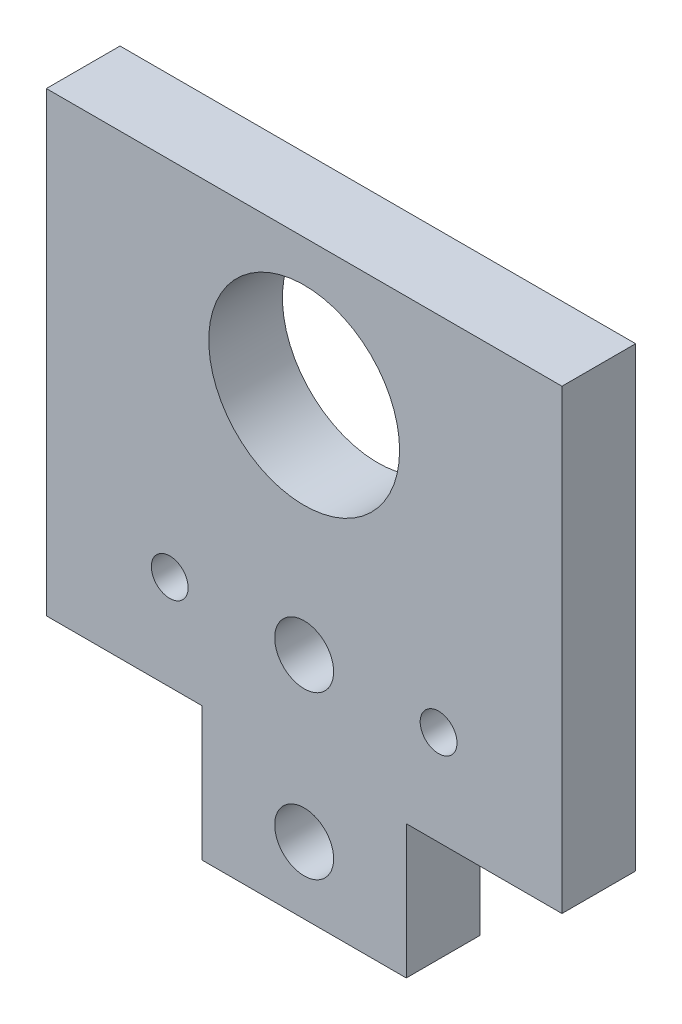
ISO-10303-21;
HEADER;
FILE_DESCRIPTION(('STEP AP214'),'2;1');
FILE_NAME('part.step','',(''),(''),'','','');
FILE_SCHEMA(('AUTOMOTIVE_DESIGN { 1 0 10303 214 1 1 1 1 }'));
ENDSEC;
DATA;
#1=APPLICATION_CONTEXT('core data for automotive mechanical design processes');
#2=APPLICATION_PROTOCOL_DEFINITION('international standard','automotive_design',2000,#1);
#3=PRODUCT_CONTEXT('',#1,'mechanical');
#4=PRODUCT('Part','Part','',(#3));
#5=PRODUCT_RELATED_PRODUCT_CATEGORY('part','',(#4));
#6=PRODUCT_DEFINITION_FORMATION('','',#4);
#7=PRODUCT_DEFINITION_CONTEXT('part definition',#1,'design');
#8=PRODUCT_DEFINITION('design','',#6,#7);
#9=PRODUCT_DEFINITION_SHAPE('','',#8);
#10=(LENGTH_UNIT() NAMED_UNIT(*) SI_UNIT(.MILLI.,.METRE.));
#11=(NAMED_UNIT(*) PLANE_ANGLE_UNIT() SI_UNIT($,.RADIAN.));
#12=(NAMED_UNIT(*) SI_UNIT($,.STERADIAN.) SOLID_ANGLE_UNIT());
#13=UNCERTAINTY_MEASURE_WITH_UNIT(LENGTH_MEASURE(1.E-05),#10,'distance_accuracy_value','');
#14=(GEOMETRIC_REPRESENTATION_CONTEXT(3) GLOBAL_UNCERTAINTY_ASSIGNED_CONTEXT((#13)) GLOBAL_UNIT_ASSIGNED_CONTEXT((#10,
#11,#12)) REPRESENTATION_CONTEXT('',''));
#15=CARTESIAN_POINT('',(0.,0.,0.));
#16=DIRECTION('',(0.,0.,1.));
#17=DIRECTION('',(1.,0.,0.));
#18=AXIS2_PLACEMENT_3D('',#15,#16,#17);
#19=CARTESIAN_POINT('',(35.,-21.92609325046,10.));
#20=DIRECTION('',(0.,1.,0.));
#21=DIRECTION('',(-1.,0.,0.));
#22=AXIS2_PLACEMENT_3D('',#19,#20,#21);
#23=PLANE('',#22);
#24=DIRECTION('',(1.,0.,0.));
#25=VECTOR('',#24,1.);
#26=CARTESIAN_POINT('',(35.,-21.92609325046,0.));
#27=LINE('',#26,#25);
#28=CARTESIAN_POINT('',(13.8610888215337,-21.92609325046,0.));
#29=VERTEX_POINT('',#28);
#30=CARTESIAN_POINT('',(35.,-21.92609325046,0.));
#31=VERTEX_POINT('',#30);
#32=EDGE_CURVE('E139',#29,#31,#27,.T.);
#33=ORIENTED_EDGE('',*,*,#32,.T.);
#34=DIRECTION('',(0.,0.,-1.));
#35=VECTOR('',#34,1.);
#36=CARTESIAN_POINT('',(35.,-21.92609325046,10.));
#37=LINE('',#36,#35);
#38=CARTESIAN_POINT('',(35.,-21.92609325046,10.));
#39=VERTEX_POINT('',#38);
#40=EDGE_CURVE('E11',#39,#31,#37,.T.);
#41=ORIENTED_EDGE('',*,*,#40,.F.);
#42=DIRECTION('',(1.,0.,0.));
#43=VECTOR('',#42,1.);
#44=CARTESIAN_POINT('',(35.,-21.92609325046,10.));
#45=LINE('',#44,#43);
#46=CARTESIAN_POINT('',(13.8610888215337,-21.92609325046,10.));
#47=VERTEX_POINT('',#46);
#48=EDGE_CURVE('E154',#47,#39,#45,.T.);
#49=ORIENTED_EDGE('',*,*,#48,.F.);
#50=DIRECTION('',(0.,0.,-1.));
#51=VECTOR('',#50,1.);
#52=CARTESIAN_POINT('',(13.8610888215337,-21.92609325046,10.));
#53=LINE('',#52,#51);
#54=EDGE_CURVE('E135',#47,#29,#53,.T.);
#55=ORIENTED_EDGE('',*,*,#54,.T.);
#56=EDGE_LOOP('',(#33,#41,#49,#55));
#57=FACE_BOUND('',#56,.T.);
#58=ADVANCED_FACE('F43',(#57),#23,.F.);
#59=CARTESIAN_POINT('',(35.,40.07390674954,10.));
#60=DIRECTION('',(-1.,0.,0.));
#61=DIRECTION('',(0.,-1.,0.));
#62=AXIS2_PLACEMENT_3D('',#59,#60,#61);
#63=PLANE('',#62);
#64=DIRECTION('',(0.,1.,0.));
#65=VECTOR('',#64,1.);
#66=CARTESIAN_POINT('',(35.,40.07390674954,0.));
#67=LINE('',#66,#65);
#68=CARTESIAN_POINT('',(35.,40.07390674954,0.));
#69=VERTEX_POINT('',#68);
#70=EDGE_CURVE('E142',#31,#69,#67,.T.);
#71=ORIENTED_EDGE('',*,*,#70,.T.);
#72=DIRECTION('',(0.,0.,-1.));
#73=VECTOR('',#72,1.);
#74=CARTESIAN_POINT('',(35.,40.07390674954,10.));
#75=LINE('',#74,#73);
#76=CARTESIAN_POINT('',(35.,40.07390674954,10.));
#77=VERTEX_POINT('',#76);
#78=EDGE_CURVE('E51',#77,#69,#75,.T.);
#79=ORIENTED_EDGE('',*,*,#78,.F.);
#80=DIRECTION('',(0.,1.,0.));
#81=VECTOR('',#80,1.);
#82=CARTESIAN_POINT('',(35.,40.07390674954,10.));
#83=LINE('',#82,#81);
#84=EDGE_CURVE('E102',#39,#77,#83,.T.);
#85=ORIENTED_EDGE('',*,*,#84,.F.);
#86=ORIENTED_EDGE('',*,*,#40,.T.);
#87=EDGE_LOOP('',(#71,#79,#85,#86));
#88=FACE_BOUND('',#87,.T.);
#89=ADVANCED_FACE('F254',(#88),#63,.F.);
#90=CARTESIAN_POINT('',(-35.,40.07390674954,10.));
#91=DIRECTION('',(0.,-1.,0.));
#92=DIRECTION('',(1.,0.,0.));
#93=AXIS2_PLACEMENT_3D('',#90,#91,#92);
#94=PLANE('',#93);
#95=DIRECTION('',(-1.,0.,0.));
#96=VECTOR('',#95,1.);
#97=CARTESIAN_POINT('',(-35.,40.07390674954,0.));
#98=LINE('',#97,#96);
#99=CARTESIAN_POINT('',(-35.,40.07390674954,0.));
#100=VERTEX_POINT('',#99);
#101=EDGE_CURVE('E145',#69,#100,#98,.T.);
#102=ORIENTED_EDGE('',*,*,#101,.T.);
#103=DIRECTION('',(0.,0.,-1.));
#104=VECTOR('',#103,1.);
#105=CARTESIAN_POINT('',(-35.,40.07390674954,10.));
#106=LINE('',#105,#104);
#107=CARTESIAN_POINT('',(-35.,40.07390674954,10.));
#108=VERTEX_POINT('',#107);
#109=EDGE_CURVE('E161',#108,#100,#106,.T.);
#110=ORIENTED_EDGE('',*,*,#109,.F.);
#111=DIRECTION('',(-1.,0.,0.));
#112=VECTOR('',#111,1.);
#113=CARTESIAN_POINT('',(-35.,40.07390674954,10.));
#114=LINE('',#113,#112);
#115=EDGE_CURVE('E169',#77,#108,#114,.T.);
#116=ORIENTED_EDGE('',*,*,#115,.F.);
#117=ORIENTED_EDGE('',*,*,#78,.T.);
#118=EDGE_LOOP('',(#102,#110,#116,#117));
#119=FACE_BOUND('',#118,.T.);
#120=ADVANCED_FACE('F167',(#119),#94,.F.);
#121=CARTESIAN_POINT('',(-35.,40.07390674954,10.));
#122=DIRECTION('',(1.,0.,0.));
#123=DIRECTION('',(0.,0.,-1.));
#124=AXIS2_PLACEMENT_3D('',#121,#122,#123);
#125=PLANE('',#124);
#126=DIRECTION('',(0.,-1.,0.));
#127=VECTOR('',#126,1.);
#128=CARTESIAN_POINT('',(-35.,40.07390674954,0.));
#129=LINE('',#128,#127);
#130=CARTESIAN_POINT('',(-35.,-21.92609325046,0.));
#131=VERTEX_POINT('',#130);
#132=EDGE_CURVE('E147',#100,#131,#129,.T.);
#133=ORIENTED_EDGE('',*,*,#132,.T.);
#134=DIRECTION('',(0.,0.,-1.));
#135=VECTOR('',#134,1.);
#136=CARTESIAN_POINT('',(-35.,-21.92609325046,10.));
#137=LINE('',#136,#135);
#138=CARTESIAN_POINT('',(-35.,-21.92609325046,10.));
#139=VERTEX_POINT('',#138);
#140=EDGE_CURVE('E158',#139,#131,#137,.T.);
#141=ORIENTED_EDGE('',*,*,#140,.F.);
#142=DIRECTION('',(0.,-1.,0.));
#143=VECTOR('',#142,1.);
#144=CARTESIAN_POINT('',(-35.,40.07390674954,10.));
#145=LINE('',#144,#143);
#146=EDGE_CURVE('E181',#108,#139,#145,.T.);
#147=ORIENTED_EDGE('',*,*,#146,.F.);
#148=ORIENTED_EDGE('',*,*,#109,.T.);
#149=EDGE_LOOP('',(#133,#141,#147,#148));
#150=FACE_BOUND('',#149,.T.);
#151=ADVANCED_FACE('F177',(#150),#125,.F.);
#152=CARTESIAN_POINT('',(-35.,-21.92609325046,10.));
#153=DIRECTION('',(0.,1.,0.));
#154=DIRECTION('',(-1.,0.,0.));
#155=AXIS2_PLACEMENT_3D('',#152,#153,#154);
#156=PLANE('',#155);
#157=DIRECTION('',(1.,0.,0.));
#158=VECTOR('',#157,1.);
#159=CARTESIAN_POINT('',(-35.,-21.92609325046,0.));
#160=LINE('',#159,#158);
#161=CARTESIAN_POINT('',(-13.8610888215337,-21.92609325046,0.));
#162=VERTEX_POINT('',#161);
#163=EDGE_CURVE('E149',#131,#162,#160,.T.);
#164=ORIENTED_EDGE('',*,*,#163,.T.);
#165=DIRECTION('',(0.,0.,-1.));
#166=VECTOR('',#165,1.);
#167=CARTESIAN_POINT('',(-13.8610888215337,-21.92609325046,10.));
#168=LINE('',#167,#166);
#169=CARTESIAN_POINT('',(-13.8610888215337,-21.92609325046,10.));
#170=VERTEX_POINT('',#169);
#171=EDGE_CURVE('E130',#170,#162,#168,.T.);
#172=ORIENTED_EDGE('',*,*,#171,.F.);
#173=DIRECTION('',(1.,0.,0.));
#174=VECTOR('',#173,1.);
#175=CARTESIAN_POINT('',(-35.,-21.92609325046,10.));
#176=LINE('',#175,#174);
#177=EDGE_CURVE('E121',#139,#170,#176,.T.);
#178=ORIENTED_EDGE('',*,*,#177,.F.);
#179=ORIENTED_EDGE('',*,*,#140,.T.);
#180=EDGE_LOOP('',(#164,#172,#178,#179));
#181=FACE_BOUND('',#180,.T.);
#182=ADVANCED_FACE('F180',(#181),#156,.F.);
#183=CARTESIAN_POINT('',(-13.8610888215337,-21.92609325046,10.));
#184=DIRECTION('',(1.,0.,0.));
#185=DIRECTION('',(0.,1.,0.));
#186=AXIS2_PLACEMENT_3D('',#183,#184,#185);
#187=PLANE('',#186);
#188=DIRECTION('',(0.,-1.,0.));
#189=VECTOR('',#188,1.);
#190=CARTESIAN_POINT('',(-13.8610888215337,-21.92609325046,0.));
#191=LINE('',#190,#189);
#192=CARTESIAN_POINT('',(-13.8610888215337,-40.07390674954,0.));
#193=VERTEX_POINT('',#192);
#194=EDGE_CURVE('E129',#162,#193,#191,.T.);
#195=ORIENTED_EDGE('',*,*,#194,.T.);
#196=DIRECTION('',(0.,0.,-1.));
#197=VECTOR('',#196,1.);
#198=CARTESIAN_POINT('',(-13.8610888215337,-40.07390674954,10.));
#199=LINE('',#198,#197);
#200=CARTESIAN_POINT('',(-13.8610888215337,-40.07390674954,10.));
#201=VERTEX_POINT('',#200);
#202=EDGE_CURVE('E126',#201,#193,#199,.T.);
#203=ORIENTED_EDGE('',*,*,#202,.F.);
#204=DIRECTION('',(0.,-1.,0.));
#205=VECTOR('',#204,1.);
#206=CARTESIAN_POINT('',(-13.8610888215337,-21.92609325046,10.));
#207=LINE('',#206,#205);
#208=EDGE_CURVE('E115',#170,#201,#207,.T.);
#209=ORIENTED_EDGE('',*,*,#208,.F.);
#210=ORIENTED_EDGE('',*,*,#171,.T.);
#211=EDGE_LOOP('',(#195,#203,#209,#210));
#212=FACE_BOUND('',#211,.T.);
#213=ADVANCED_FACE('F127',(#212),#187,.F.);
#214=CARTESIAN_POINT('',(13.8610888215337,-40.07390674954,10.));
#215=DIRECTION('',(0.,1.,0.));
#216=DIRECTION('',(0.,0.,1.));
#217=AXIS2_PLACEMENT_3D('',#214,#215,#216);
#218=PLANE('',#217);
#219=DIRECTION('',(1.,0.,0.));
#220=VECTOR('',#219,1.);
#221=CARTESIAN_POINT('',(13.8610888215337,-40.07390674954,0.));
#222=LINE('',#221,#220);
#223=CARTESIAN_POINT('',(13.8610888215337,-40.07390674954,0.));
#224=VERTEX_POINT('',#223);
#225=EDGE_CURVE('E88',#193,#224,#222,.T.);
#226=ORIENTED_EDGE('',*,*,#225,.T.);
#227=DIRECTION('',(0.,0.,-1.));
#228=VECTOR('',#227,1.);
#229=CARTESIAN_POINT('',(13.8610888215337,-40.07390674954,10.));
#230=LINE('',#229,#228);
#231=CARTESIAN_POINT('',(13.8610888215337,-40.07390674954,10.));
#232=VERTEX_POINT('',#231);
#233=EDGE_CURVE('E131',#232,#224,#230,.T.);
#234=ORIENTED_EDGE('',*,*,#233,.F.);
#235=DIRECTION('',(1.,0.,0.));
#236=VECTOR('',#235,1.);
#237=CARTESIAN_POINT('',(13.8610888215337,-40.07390674954,10.));
#238=LINE('',#237,#236);
#239=EDGE_CURVE('E119',#201,#232,#238,.T.);
#240=ORIENTED_EDGE('',*,*,#239,.F.);
#241=ORIENTED_EDGE('',*,*,#202,.T.);
#242=EDGE_LOOP('',(#226,#234,#240,#241));
#243=FACE_BOUND('',#242,.T.);
#244=ADVANCED_FACE('F133',(#243),#218,.F.);
#245=CARTESIAN_POINT('',(13.8610888215337,-21.92609325046,10.));
#246=DIRECTION('',(-1.,0.,0.));
#247=DIRECTION('',(0.,-1.,0.));
#248=AXIS2_PLACEMENT_3D('',#245,#246,#247);
#249=PLANE('',#248);
#250=DIRECTION('',(0.,1.,0.));
#251=VECTOR('',#250,1.);
#252=CARTESIAN_POINT('',(13.8610888215337,-21.92609325046,0.));
#253=LINE('',#252,#251);
#254=EDGE_CURVE('E94',#224,#29,#253,.T.);
#255=ORIENTED_EDGE('',*,*,#254,.T.);
#256=ORIENTED_EDGE('',*,*,#54,.F.);
#257=DIRECTION('',(0.,1.,0.));
#258=VECTOR('',#257,1.);
#259=CARTESIAN_POINT('',(13.8610888215337,-21.92609325046,10.));
#260=LINE('',#259,#258);
#261=EDGE_CURVE('E59',#232,#47,#260,.T.);
#262=ORIENTED_EDGE('',*,*,#261,.F.);
#263=ORIENTED_EDGE('',*,*,#233,.T.);
#264=EDGE_LOOP('',(#255,#256,#262,#263));
#265=FACE_BOUND('',#264,.T.);
#266=ADVANCED_FACE('F228',(#265),#249,.F.);
#267=CARTESIAN_POINT('',(0.,0.,10.));
#268=DIRECTION('',(0.,0.,1.));
#269=DIRECTION('',(1.,0.,0.));
#270=AXIS2_PLACEMENT_3D('',#267,#268,#269);
#271=PLANE('',#270);
#272=CARTESIAN_POINT('',(0.,21.51390674954,10.));
#273=DIRECTION('',(0.,0.,1.));
#274=DIRECTION('',(1.,0.,0.));
#275=AXIS2_PLACEMENT_3D('',#272,#273,#274);
#276=CIRCLE('',#275,12.955);
#277=CARTESIAN_POINT('',(12.955,21.51390674954,10.));
#278=VERTEX_POINT('',#277);
#279=EDGE_CURVE('E211',#278,#278,#276,.T.);
#280=ORIENTED_EDGE('',*,*,#279,.F.);
#281=EDGE_LOOP('',(#280));
#282=FACE_BOUND('',#281,.T.);
#283=CARTESIAN_POINT('',(0.,-31.,10.));
#284=DIRECTION('',(0.,0.,1.));
#285=DIRECTION('',(1.,0.,0.));
#286=AXIS2_PLACEMENT_3D('',#283,#284,#285);
#287=CIRCLE('',#286,4.);
#288=CARTESIAN_POINT('',(4.00000000000001,-31.,10.));
#289=VERTEX_POINT('',#288);
#290=EDGE_CURVE('E206',#289,#289,#287,.T.);
#291=ORIENTED_EDGE('',*,*,#290,.F.);
#292=EDGE_LOOP('',(#291));
#293=FACE_BOUND('',#292,.T.);
#294=CARTESIAN_POINT('',(0.,-9.00000000000001,10.));
#295=DIRECTION('',(0.,0.,1.));
#296=DIRECTION('',(1.,0.,0.));
#297=AXIS2_PLACEMENT_3D('',#294,#295,#296);
#298=CIRCLE('',#297,4.);
#299=CARTESIAN_POINT('',(4.,-9.00000000000001,10.));
#300=VERTEX_POINT('',#299);
#301=EDGE_CURVE('E203',#300,#300,#298,.T.);
#302=ORIENTED_EDGE('',*,*,#301,.F.);
#303=EDGE_LOOP('',(#302));
#304=FACE_BOUND('',#303,.T.);
#305=CARTESIAN_POINT('',(18.25,-9.00000000000001,10.));
#306=DIRECTION('',(0.,0.,1.));
#307=DIRECTION('',(1.,0.,0.));
#308=AXIS2_PLACEMENT_3D('',#305,#306,#307);
#309=CIRCLE('',#308,2.5);
#310=CARTESIAN_POINT('',(20.75,-9.00000000000001,10.));
#311=VERTEX_POINT('',#310);
#312=EDGE_CURVE('E197',#311,#311,#309,.T.);
#313=ORIENTED_EDGE('',*,*,#312,.F.);
#314=EDGE_LOOP('',(#313));
#315=FACE_BOUND('',#314,.T.);
#316=CARTESIAN_POINT('',(-18.25,-9.00000000000001,10.));
#317=DIRECTION('',(0.,0.,1.));
#318=DIRECTION('',(1.,0.,0.));
#319=AXIS2_PLACEMENT_3D('',#316,#317,#318);
#320=CIRCLE('',#319,2.5);
#321=CARTESIAN_POINT('',(-15.75,-9.00000000000001,10.));
#322=VERTEX_POINT('',#321);
#323=EDGE_CURVE('E190',#322,#322,#320,.T.);
#324=ORIENTED_EDGE('',*,*,#323,.F.);
#325=EDGE_LOOP('',(#324));
#326=FACE_BOUND('',#325,.T.);
#327=ORIENTED_EDGE('',*,*,#48,.T.);
#328=ORIENTED_EDGE('',*,*,#84,.T.);
#329=ORIENTED_EDGE('',*,*,#115,.T.);
#330=ORIENTED_EDGE('',*,*,#146,.T.);
#331=ORIENTED_EDGE('',*,*,#177,.T.);
#332=ORIENTED_EDGE('',*,*,#208,.T.);
#333=ORIENTED_EDGE('',*,*,#239,.T.);
#334=ORIENTED_EDGE('',*,*,#261,.T.);
#335=EDGE_LOOP('',(#327,#328,#329,#330,#331,#332,#333,#334));
#336=FACE_BOUND('',#335,.T.);
#337=ADVANCED_FACE('F117',(#282,#293,#304,#315,#326,#336),#271,.T.);
#338=CARTESIAN_POINT('',(0.,0.,0.));
#339=DIRECTION('',(0.,0.,1.));
#340=DIRECTION('',(1.,0.,0.));
#341=AXIS2_PLACEMENT_3D('',#338,#339,#340);
#342=PLANE('',#341);
#343=CARTESIAN_POINT('',(0.,21.51390674954,0.));
#344=DIRECTION('',(0.,0.,1.));
#345=DIRECTION('',(1.,0.,0.));
#346=AXIS2_PLACEMENT_3D('',#343,#344,#345);
#347=CIRCLE('',#346,12.955);
#348=CARTESIAN_POINT('',(12.955,21.51390674954,0.));
#349=VERTEX_POINT('',#348);
#350=EDGE_CURVE('E191',#349,#349,#347,.T.);
#351=ORIENTED_EDGE('',*,*,#350,.T.);
#352=EDGE_LOOP('',(#351));
#353=FACE_BOUND('',#352,.T.);
#354=CARTESIAN_POINT('',(0.,-31.,0.));
#355=DIRECTION('',(0.,0.,1.));
#356=DIRECTION('',(1.,0.,0.));
#357=AXIS2_PLACEMENT_3D('',#354,#355,#356);
#358=CIRCLE('',#357,4.);
#359=CARTESIAN_POINT('',(4.00000000000001,-31.,0.));
#360=VERTEX_POINT('',#359);
#361=EDGE_CURVE('E143',#360,#360,#358,.T.);
#362=ORIENTED_EDGE('',*,*,#361,.T.);
#363=EDGE_LOOP('',(#362));
#364=FACE_BOUND('',#363,.T.);
#365=CARTESIAN_POINT('',(0.,-9.00000000000001,0.));
#366=DIRECTION('',(0.,0.,1.));
#367=DIRECTION('',(1.,0.,0.));
#368=AXIS2_PLACEMENT_3D('',#365,#366,#367);
#369=CIRCLE('',#368,4.);
#370=CARTESIAN_POINT('',(4.,-9.00000000000001,0.));
#371=VERTEX_POINT('',#370);
#372=EDGE_CURVE('E200',#371,#371,#369,.T.);
#373=ORIENTED_EDGE('',*,*,#372,.T.);
#374=EDGE_LOOP('',(#373));
#375=FACE_BOUND('',#374,.T.);
#376=CARTESIAN_POINT('',(18.25,-9.00000000000001,0.));
#377=DIRECTION('',(0.,0.,1.));
#378=DIRECTION('',(1.,0.,0.));
#379=AXIS2_PLACEMENT_3D('',#376,#377,#378);
#380=CIRCLE('',#379,2.5);
#381=CARTESIAN_POINT('',(20.75,-9.00000000000001,0.));
#382=VERTEX_POINT('',#381);
#383=EDGE_CURVE('E194',#382,#382,#380,.T.);
#384=ORIENTED_EDGE('',*,*,#383,.T.);
#385=EDGE_LOOP('',(#384));
#386=FACE_BOUND('',#385,.T.);
#387=CARTESIAN_POINT('',(-18.25,-9.00000000000001,0.));
#388=DIRECTION('',(0.,0.,1.));
#389=DIRECTION('',(1.,0.,0.));
#390=AXIS2_PLACEMENT_3D('',#387,#388,#389);
#391=CIRCLE('',#390,2.5);
#392=CARTESIAN_POINT('',(-15.75,-9.00000000000001,0.));
#393=VERTEX_POINT('',#392);
#394=EDGE_CURVE('E187',#393,#393,#391,.T.);
#395=ORIENTED_EDGE('',*,*,#394,.T.);
#396=EDGE_LOOP('',(#395));
#397=FACE_BOUND('',#396,.T.);
#398=ORIENTED_EDGE('',*,*,#32,.F.);
#399=ORIENTED_EDGE('',*,*,#254,.F.);
#400=ORIENTED_EDGE('',*,*,#225,.F.);
#401=ORIENTED_EDGE('',*,*,#194,.F.);
#402=ORIENTED_EDGE('',*,*,#163,.F.);
#403=ORIENTED_EDGE('',*,*,#132,.F.);
#404=ORIENTED_EDGE('',*,*,#101,.F.);
#405=ORIENTED_EDGE('',*,*,#70,.F.);
#406=EDGE_LOOP('',(#398,#399,#400,#401,#402,#403,#404,#405));
#407=FACE_BOUND('',#406,.T.);
#408=ADVANCED_FACE('F173',(#353,#364,#375,#386,#397,#407),#342,.F.);
#409=CARTESIAN_POINT('',(-18.25,-9.00000000000001,0.));
#410=DIRECTION('',(0.,0.,1.));
#411=DIRECTION('',(1.,0.,0.));
#412=AXIS2_PLACEMENT_3D('',#409,#410,#411);
#413=CYLINDRICAL_SURFACE('',#412,2.5);
#414=ORIENTED_EDGE('',*,*,#394,.F.);
#415=EDGE_LOOP('',(#414));
#416=FACE_BOUND('',#415,.T.);
#417=ORIENTED_EDGE('',*,*,#323,.T.);
#418=EDGE_LOOP('',(#417));
#419=FACE_BOUND('',#418,.T.);
#420=ADVANCED_FACE('F238',(#416,#419),#413,.F.);
#421=CARTESIAN_POINT('',(18.25,-9.00000000000001,0.));
#422=DIRECTION('',(0.,0.,1.));
#423=DIRECTION('',(1.,0.,0.));
#424=AXIS2_PLACEMENT_3D('',#421,#422,#423);
#425=CYLINDRICAL_SURFACE('',#424,2.5);
#426=ORIENTED_EDGE('',*,*,#383,.F.);
#427=EDGE_LOOP('',(#426));
#428=FACE_BOUND('',#427,.T.);
#429=ORIENTED_EDGE('',*,*,#312,.T.);
#430=EDGE_LOOP('',(#429));
#431=FACE_BOUND('',#430,.T.);
#432=ADVANCED_FACE('F240',(#428,#431),#425,.F.);
#433=CARTESIAN_POINT('',(0.,-9.00000000000001,0.));
#434=DIRECTION('',(0.,0.,1.));
#435=DIRECTION('',(1.,0.,0.));
#436=AXIS2_PLACEMENT_3D('',#433,#434,#435);
#437=CYLINDRICAL_SURFACE('',#436,4.);
#438=ORIENTED_EDGE('',*,*,#372,.F.);
#439=EDGE_LOOP('',(#438));
#440=FACE_BOUND('',#439,.T.);
#441=ORIENTED_EDGE('',*,*,#301,.T.);
#442=EDGE_LOOP('',(#441));
#443=FACE_BOUND('',#442,.T.);
#444=ADVANCED_FACE('F247',(#440,#443),#437,.F.);
#445=CARTESIAN_POINT('',(0.,-31.,0.));
#446=DIRECTION('',(0.,0.,1.));
#447=DIRECTION('',(1.,0.,0.));
#448=AXIS2_PLACEMENT_3D('',#445,#446,#447);
#449=CYLINDRICAL_SURFACE('',#448,4.);
#450=ORIENTED_EDGE('',*,*,#361,.F.);
#451=EDGE_LOOP('',(#450));
#452=FACE_BOUND('',#451,.T.);
#453=ORIENTED_EDGE('',*,*,#290,.T.);
#454=EDGE_LOOP('',(#453));
#455=FACE_BOUND('',#454,.T.);
#456=ADVANCED_FACE('F222',(#452,#455),#449,.F.);
#457=CARTESIAN_POINT('',(0.,21.51390674954,0.));
#458=DIRECTION('',(0.,0.,1.));
#459=DIRECTION('',(1.,0.,0.));
#460=AXIS2_PLACEMENT_3D('',#457,#458,#459);
#461=CYLINDRICAL_SURFACE('',#460,12.955);
#462=ORIENTED_EDGE('',*,*,#350,.F.);
#463=EDGE_LOOP('',(#462));
#464=FACE_BOUND('',#463,.T.);
#465=ORIENTED_EDGE('',*,*,#279,.T.);
#466=EDGE_LOOP('',(#465));
#467=FACE_BOUND('',#466,.T.);
#468=ADVANCED_FACE('F219',(#464,#467),#461,.F.);
#469=CLOSED_SHELL('',(#58,#89,#120,#151,#182,#213,#244,#266,#337,#408,#420,#432,#444,#456,#468));
#470=MANIFOLD_SOLID_BREP('B2',#469);
#471=ADVANCED_BREP_SHAPE_REPRESENTATION('',(#18,#470),#14);
#472=SHAPE_DEFINITION_REPRESENTATION(#9,#471);
ENDSEC;
END-ISO-10303-21;
